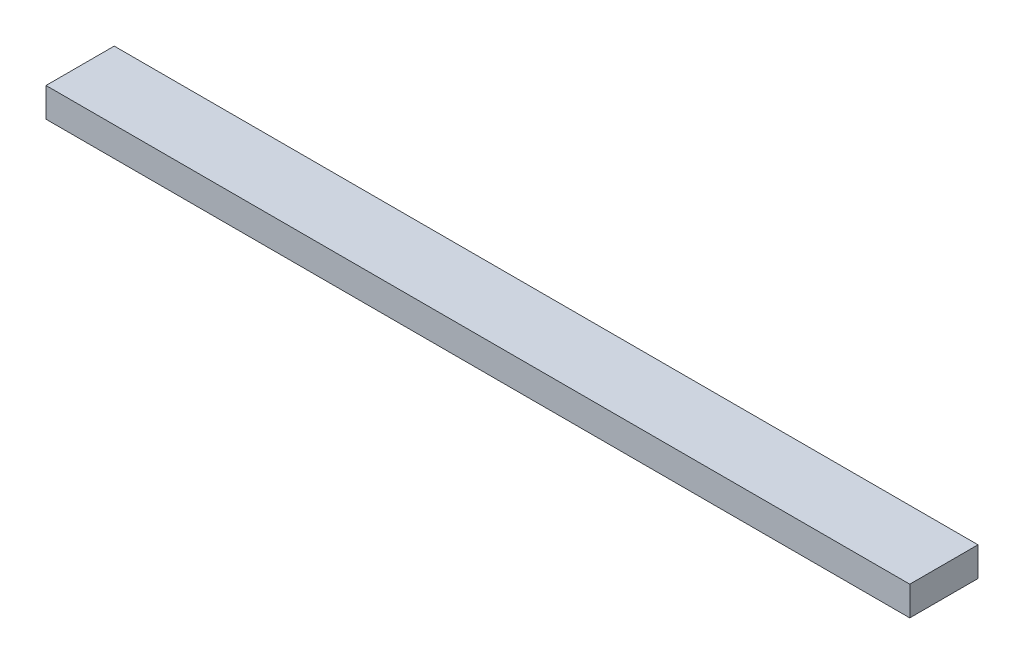
ISO-10303-21;
HEADER;
FILE_DESCRIPTION(('STEP AP214'),'2;1');
FILE_NAME('part.step','',(''),(''),'','','');
FILE_SCHEMA(('AUTOMOTIVE_DESIGN { 1 0 10303 214 1 1 1 1 }'));
ENDSEC;
DATA;
#1=APPLICATION_CONTEXT('core data for automotive mechanical design processes');
#2=APPLICATION_PROTOCOL_DEFINITION('international standard','automotive_design',2000,#1);
#3=PRODUCT_CONTEXT('',#1,'mechanical');
#4=PRODUCT('Part','Part','',(#3));
#5=PRODUCT_RELATED_PRODUCT_CATEGORY('part','',(#4));
#6=PRODUCT_DEFINITION_FORMATION('','',#4);
#7=PRODUCT_DEFINITION_CONTEXT('part definition',#1,'design');
#8=PRODUCT_DEFINITION('design','',#6,#7);
#9=PRODUCT_DEFINITION_SHAPE('','',#8);
#10=(LENGTH_UNIT() NAMED_UNIT(*) SI_UNIT(.MILLI.,.METRE.));
#11=(NAMED_UNIT(*) PLANE_ANGLE_UNIT() SI_UNIT($,.RADIAN.));
#12=(NAMED_UNIT(*) SI_UNIT($,.STERADIAN.) SOLID_ANGLE_UNIT());
#13=UNCERTAINTY_MEASURE_WITH_UNIT(LENGTH_MEASURE(1.E-05),#10,'distance_accuracy_value','');
#14=(GEOMETRIC_REPRESENTATION_CONTEXT(3) GLOBAL_UNCERTAINTY_ASSIGNED_CONTEXT((#13)) GLOBAL_UNIT_ASSIGNED_CONTEXT((#10,
#11,#12)) REPRESENTATION_CONTEXT('',''));
#15=CARTESIAN_POINT('',(0.,0.,0.));
#16=DIRECTION('',(0.,0.,1.));
#17=DIRECTION('',(1.,0.,0.));
#18=AXIS2_PLACEMENT_3D('',#15,#16,#17);
#19=CARTESIAN_POINT('',(0.,38.1,0.));
#20=DIRECTION('',(1.,0.,0.));
#21=DIRECTION('',(0.,0.,-1.));
#22=AXIS2_PLACEMENT_3D('',#19,#20,#21);
#23=PLANE('',#22);
#24=DIRECTION('',(0.,0.,1.));
#25=VECTOR('',#24,1.);
#26=CARTESIAN_POINT('',(0.,0.,0.));
#27=LINE('',#26,#25);
#28=CARTESIAN_POINT('',(0.,0.,-88.9));
#29=VERTEX_POINT('',#28);
#30=CARTESIAN_POINT('',(0.,0.,0.));
#31=VERTEX_POINT('',#30);
#32=EDGE_CURVE('E103',#29,#31,#27,.T.);
#33=ORIENTED_EDGE('',*,*,#32,.T.);
#34=DIRECTION('',(0.,-1.,0.));
#35=VECTOR('',#34,1.);
#36=CARTESIAN_POINT('',(0.,38.1,0.));
#37=LINE('',#36,#35);
#38=CARTESIAN_POINT('',(0.,38.1,0.));
#39=VERTEX_POINT('',#38);
#40=EDGE_CURVE('E11',#39,#31,#37,.T.);
#41=ORIENTED_EDGE('',*,*,#40,.F.);
#42=DIRECTION('',(0.,0.,1.));
#43=VECTOR('',#42,1.);
#44=CARTESIAN_POINT('',(0.,38.1,0.));
#45=LINE('',#44,#43);
#46=CARTESIAN_POINT('',(0.,38.1,-88.9));
#47=VERTEX_POINT('',#46);
#48=EDGE_CURVE('E91',#47,#39,#45,.T.);
#49=ORIENTED_EDGE('',*,*,#48,.F.);
#50=DIRECTION('',(0.,-1.,0.));
#51=VECTOR('',#50,1.);
#52=CARTESIAN_POINT('',(0.,38.1,-88.9));
#53=LINE('',#52,#51);
#54=EDGE_CURVE('E99',#47,#29,#53,.T.);
#55=ORIENTED_EDGE('',*,*,#54,.T.);
#56=EDGE_LOOP('',(#33,#41,#49,#55));
#57=FACE_BOUND('',#56,.T.);
#58=ADVANCED_FACE('F40',(#57),#23,.F.);
#59=CARTESIAN_POINT('',(0.,38.1,0.));
#60=DIRECTION('',(0.,0.,-1.));
#61=DIRECTION('',(-1.,0.,0.));
#62=AXIS2_PLACEMENT_3D('',#59,#60,#61);
#63=PLANE('',#62);
#64=DIRECTION('',(1.,0.,0.));
#65=VECTOR('',#64,1.);
#66=CARTESIAN_POINT('',(0.,0.,0.));
#67=LINE('',#66,#65);
#68=CARTESIAN_POINT('',(1125.5502,0.,0.));
#69=VERTEX_POINT('',#68);
#70=EDGE_CURVE('E95',#31,#69,#67,.T.);
#71=ORIENTED_EDGE('',*,*,#70,.T.);
#72=DIRECTION('',(0.,-1.,0.));
#73=VECTOR('',#72,1.);
#74=CARTESIAN_POINT('',(1125.5502,38.1,0.));
#75=LINE('',#74,#73);
#76=CARTESIAN_POINT('',(1125.5502,38.1,0.));
#77=VERTEX_POINT('',#76);
#78=EDGE_CURVE('E48',#77,#69,#75,.T.);
#79=ORIENTED_EDGE('',*,*,#78,.F.);
#80=DIRECTION('',(1.,0.,0.));
#81=VECTOR('',#80,1.);
#82=CARTESIAN_POINT('',(0.,38.1,0.));
#83=LINE('',#82,#81);
#84=EDGE_CURVE('E86',#39,#77,#83,.T.);
#85=ORIENTED_EDGE('',*,*,#84,.F.);
#86=ORIENTED_EDGE('',*,*,#40,.T.);
#87=EDGE_LOOP('',(#71,#79,#85,#86));
#88=FACE_BOUND('',#87,.T.);
#89=ADVANCED_FACE('F94',(#88),#63,.F.);
#90=CARTESIAN_POINT('',(1125.5502,38.1,0.));
#91=DIRECTION('',(-1.,0.,0.));
#92=DIRECTION('',(0.,0.,1.));
#93=AXIS2_PLACEMENT_3D('',#90,#91,#92);
#94=PLANE('',#93);
#95=DIRECTION('',(0.,0.,-1.));
#96=VECTOR('',#95,1.);
#97=CARTESIAN_POINT('',(1125.5502,0.,0.));
#98=LINE('',#97,#96);
#99=CARTESIAN_POINT('',(1125.5502,0.,-88.9));
#100=VERTEX_POINT('',#99);
#101=EDGE_CURVE('E73',#69,#100,#98,.T.);
#102=ORIENTED_EDGE('',*,*,#101,.T.);
#103=DIRECTION('',(0.,-1.,0.));
#104=VECTOR('',#103,1.);
#105=CARTESIAN_POINT('',(1125.5502,38.1,-88.9));
#106=LINE('',#105,#104);
#107=CARTESIAN_POINT('',(1125.5502,38.1,-88.9));
#108=VERTEX_POINT('',#107);
#109=EDGE_CURVE('E96',#108,#100,#106,.T.);
#110=ORIENTED_EDGE('',*,*,#109,.F.);
#111=DIRECTION('',(0.,0.,-1.));
#112=VECTOR('',#111,1.);
#113=CARTESIAN_POINT('',(1125.5502,38.1,0.));
#114=LINE('',#113,#112);
#115=EDGE_CURVE('E89',#77,#108,#114,.T.);
#116=ORIENTED_EDGE('',*,*,#115,.F.);
#117=ORIENTED_EDGE('',*,*,#78,.T.);
#118=EDGE_LOOP('',(#102,#110,#116,#117));
#119=FACE_BOUND('',#118,.T.);
#120=ADVANCED_FACE('F97',(#119),#94,.F.);
#121=CARTESIAN_POINT('',(0.,38.1,-88.9));
#122=DIRECTION('',(0.,0.,1.));
#123=DIRECTION('',(1.,0.,0.));
#124=AXIS2_PLACEMENT_3D('',#121,#122,#123);
#125=PLANE('',#124);
#126=DIRECTION('',(-1.,0.,0.));
#127=VECTOR('',#126,1.);
#128=CARTESIAN_POINT('',(0.,0.,-88.9));
#129=LINE('',#128,#127);
#130=EDGE_CURVE('E79',#100,#29,#129,.T.);
#131=ORIENTED_EDGE('',*,*,#130,.T.);
#132=ORIENTED_EDGE('',*,*,#54,.F.);
#133=DIRECTION('',(-1.,0.,0.));
#134=VECTOR('',#133,1.);
#135=CARTESIAN_POINT('',(0.,38.1,-88.9));
#136=LINE('',#135,#134);
#137=EDGE_CURVE('E56',#108,#47,#136,.T.);
#138=ORIENTED_EDGE('',*,*,#137,.F.);
#139=ORIENTED_EDGE('',*,*,#109,.T.);
#140=EDGE_LOOP('',(#131,#132,#138,#139));
#141=FACE_BOUND('',#140,.T.);
#142=ADVANCED_FACE('F110',(#141),#125,.F.);
#143=CARTESIAN_POINT('',(0.,38.1,0.));
#144=DIRECTION('',(0.,-1.,0.));
#145=DIRECTION('',(0.,0.,-1.));
#146=AXIS2_PLACEMENT_3D('',#143,#144,#145);
#147=PLANE('',#146);
#148=ORIENTED_EDGE('',*,*,#48,.T.);
#149=ORIENTED_EDGE('',*,*,#84,.T.);
#150=ORIENTED_EDGE('',*,*,#115,.T.);
#151=ORIENTED_EDGE('',*,*,#137,.T.);
#152=EDGE_LOOP('',(#148,#149,#150,#151));
#153=FACE_BOUND('',#152,.T.);
#154=ADVANCED_FACE('F87',(#153),#147,.F.);
#155=CARTESIAN_POINT('',(0.,0.,0.));
#156=DIRECTION('',(0.,-1.,0.));
#157=DIRECTION('',(0.,0.,-1.));
#158=AXIS2_PLACEMENT_3D('',#155,#156,#157);
#159=PLANE('',#158);
#160=ORIENTED_EDGE('',*,*,#32,.F.);
#161=ORIENTED_EDGE('',*,*,#130,.F.);
#162=ORIENTED_EDGE('',*,*,#101,.F.);
#163=ORIENTED_EDGE('',*,*,#70,.F.);
#164=EDGE_LOOP('',(#160,#161,#162,#163));
#165=FACE_BOUND('',#164,.T.);
#166=ADVANCED_FACE('F113',(#165),#159,.T.);
#167=CLOSED_SHELL('',(#58,#89,#120,#142,#154,#166));
#168=MANIFOLD_SOLID_BREP('B2',#167);
#169=ADVANCED_BREP_SHAPE_REPRESENTATION('',(#18,#168),#14);
#170=SHAPE_DEFINITION_REPRESENTATION(#9,#169);
ENDSEC;
END-ISO-10303-21;
